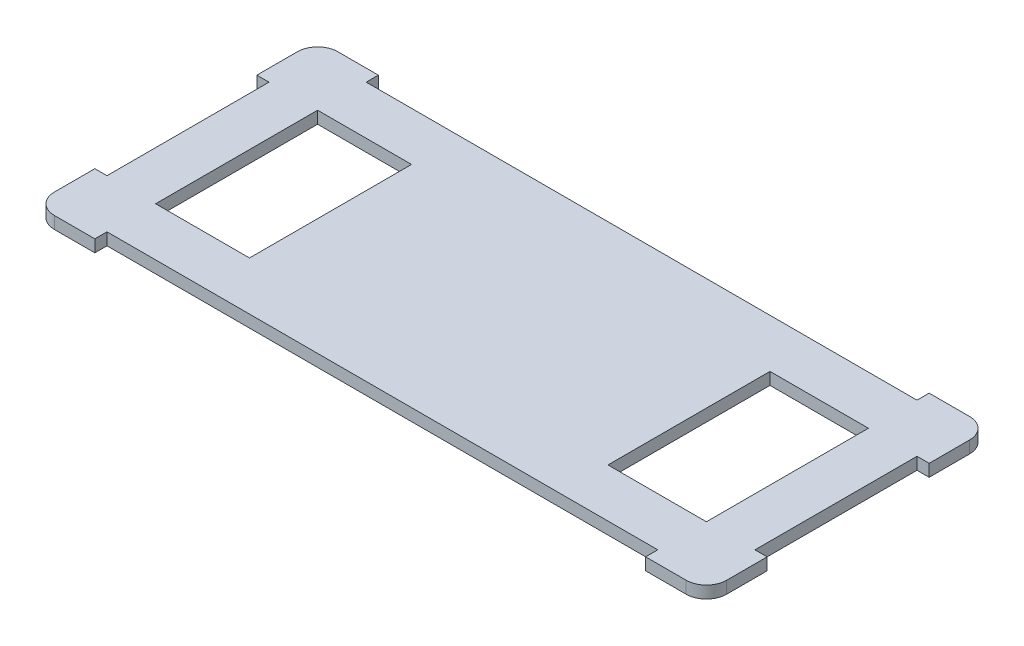
ISO-10303-21;
HEADER;
FILE_DESCRIPTION(('STEP AP214'),'2;1');
FILE_NAME('part.step','',(''),(''),'','','');
FILE_SCHEMA(('AUTOMOTIVE_DESIGN { 1 0 10303 214 1 1 1 1 }'));
ENDSEC;
DATA;
#1=APPLICATION_CONTEXT('core data for automotive mechanical design processes');
#2=APPLICATION_PROTOCOL_DEFINITION('international standard','automotive_design',2000,#1);
#3=PRODUCT_CONTEXT('',#1,'mechanical');
#4=PRODUCT('Part','Part','',(#3));
#5=PRODUCT_RELATED_PRODUCT_CATEGORY('part','',(#4));
#6=PRODUCT_DEFINITION_FORMATION('','',#4);
#7=PRODUCT_DEFINITION_CONTEXT('part definition',#1,'design');
#8=PRODUCT_DEFINITION('design','',#6,#7);
#9=PRODUCT_DEFINITION_SHAPE('','',#8);
#10=(LENGTH_UNIT() NAMED_UNIT(*) SI_UNIT(.MILLI.,.METRE.));
#11=(NAMED_UNIT(*) PLANE_ANGLE_UNIT() SI_UNIT($,.RADIAN.));
#12=(NAMED_UNIT(*) SI_UNIT($,.STERADIAN.) SOLID_ANGLE_UNIT());
#13=UNCERTAINTY_MEASURE_WITH_UNIT(LENGTH_MEASURE(1.E-05),#10,'distance_accuracy_value','');
#14=(GEOMETRIC_REPRESENTATION_CONTEXT(3) GLOBAL_UNCERTAINTY_ASSIGNED_CONTEXT((#13)) GLOBAL_UNIT_ASSIGNED_CONTEXT((#10,
#11,#12)) REPRESENTATION_CONTEXT('',''));
#15=CARTESIAN_POINT('',(0.,0.,0.));
#16=DIRECTION('',(0.,0.,1.));
#17=DIRECTION('',(1.,0.,0.));
#18=AXIS2_PLACEMENT_3D('',#15,#16,#17);
#19=CARTESIAN_POINT('',(-98.3544303797468,-0.0100000000000031,-32.8481012658228));
#20=DIRECTION('',(0.,0.,-1.));
#21=DIRECTION('',(-1.,0.,0.));
#22=AXIS2_PLACEMENT_3D('',#19,#20,#21);
#23=PLANE('',#22);
#24=DIRECTION('',(0.,1.,0.));
#25=VECTOR('',#24,1.);
#26=CARTESIAN_POINT('',(-95.3544303797468,-0.0100000000000031,-32.8481012658228));
#27=LINE('',#26,#25);
#28=CARTESIAN_POINT('',(-95.3544303797468,0.,-32.8481012658228));
#29=VERTEX_POINT('',#28);
#30=CARTESIAN_POINT('',(-95.3544303797468,3.,-32.8481012658228));
#31=VERTEX_POINT('',#30);
#32=EDGE_CURVE('E36',#29,#31,#27,.T.);
#33=ORIENTED_EDGE('',*,*,#32,.T.);
#34=DIRECTION('',(-1.,0.,0.));
#35=VECTOR('',#34,1.);
#36=CARTESIAN_POINT('',(0.,3.,-32.8481012658228));
#37=LINE('',#36,#35);
#38=CARTESIAN_POINT('',(-98.3544303797468,3.,-32.8481012658228));
#39=VERTEX_POINT('',#38);
#40=EDGE_CURVE('E395',#31,#39,#37,.T.);
#41=ORIENTED_EDGE('',*,*,#40,.T.);
#42=DIRECTION('',(0.,1.,0.));
#43=VECTOR('',#42,1.);
#44=CARTESIAN_POINT('',(-98.3544303797468,50.,-32.8481012658228));
#45=LINE('',#44,#43);
#46=CARTESIAN_POINT('',(-98.3544303797468,0.,-32.8481012658228));
#47=VERTEX_POINT('',#46);
#48=EDGE_CURVE('E325',#47,#39,#45,.T.);
#49=ORIENTED_EDGE('',*,*,#48,.F.);
#50=DIRECTION('',(-1.,0.,0.));
#51=VECTOR('',#50,1.);
#52=CARTESIAN_POINT('',(0.,0.,-32.8481012658228));
#53=LINE('',#52,#51);
#54=EDGE_CURVE('E319',#29,#47,#53,.T.);
#55=ORIENTED_EDGE('',*,*,#54,.F.);
#56=EDGE_LOOP('',(#33,#41,#49,#55));
#57=FACE_BOUND('',#56,.T.);
#58=ADVANCED_FACE('F32',(#57),#23,.F.);
#59=CARTESIAN_POINT('',(-95.3544303797468,-0.0100000000000031,-32.8481012658228));
#60=DIRECTION('',(1.,0.,0.));
#61=DIRECTION('',(0.,0.,-1.));
#62=AXIS2_PLACEMENT_3D('',#59,#60,#61);
#63=PLANE('',#62);
#64=DIRECTION('',(0.,1.,0.));
#65=VECTOR('',#64,1.);
#66=CARTESIAN_POINT('',(-95.3544303797468,-0.0100000000000031,7.15189873417722));
#67=LINE('',#66,#65);
#68=CARTESIAN_POINT('',(-95.3544303797468,0.,7.15189873417722));
#69=VERTEX_POINT('',#68);
#70=CARTESIAN_POINT('',(-95.3544303797468,3.,7.15189873417722));
#71=VERTEX_POINT('',#70);
#72=EDGE_CURVE('E463',#69,#71,#67,.T.);
#73=ORIENTED_EDGE('',*,*,#72,.T.);
#74=DIRECTION('',(0.,0.,-1.));
#75=VECTOR('',#74,1.);
#76=CARTESIAN_POINT('',(-95.3544303797468,3.,0.));
#77=LINE('',#76,#75);
#78=EDGE_CURVE('E480',#71,#31,#77,.T.);
#79=ORIENTED_EDGE('',*,*,#78,.T.);
#80=ORIENTED_EDGE('',*,*,#32,.F.);
#81=DIRECTION('',(0.,0.,-1.));
#82=VECTOR('',#81,1.);
#83=CARTESIAN_POINT('',(-95.3544303797468,0.,0.));
#84=LINE('',#83,#82);
#85=EDGE_CURVE('E315',#69,#29,#84,.T.);
#86=ORIENTED_EDGE('',*,*,#85,.F.);
#87=EDGE_LOOP('',(#73,#79,#80,#86));
#88=FACE_BOUND('',#87,.T.);
#89=ADVANCED_FACE('F492',(#88),#63,.F.);
#90=CARTESIAN_POINT('',(-98.3544303797468,-0.0100000000000031,7.15189873417722));
#91=DIRECTION('',(0.,0.,1.));
#92=DIRECTION('',(1.,0.,0.));
#93=AXIS2_PLACEMENT_3D('',#90,#91,#92);
#94=PLANE('',#93);
#95=DIRECTION('',(0.,-1.,0.));
#96=VECTOR('',#95,1.);
#97=CARTESIAN_POINT('',(-98.3544303797468,50.,7.15189873417722));
#98=LINE('',#97,#96);
#99=CARTESIAN_POINT('',(-98.3544303797468,3.,7.15189873417722));
#100=VERTEX_POINT('',#99);
#101=CARTESIAN_POINT('',(-98.3544303797468,0.,7.15189873417722));
#102=VERTEX_POINT('',#101);
#103=EDGE_CURVE('E322',#100,#102,#98,.T.);
#104=ORIENTED_EDGE('',*,*,#103,.F.);
#105=DIRECTION('',(1.,0.,0.));
#106=VECTOR('',#105,1.);
#107=CARTESIAN_POINT('',(0.,3.,7.15189873417733));
#108=LINE('',#107,#106);
#109=EDGE_CURVE('E470',#100,#71,#108,.T.);
#110=ORIENTED_EDGE('',*,*,#109,.T.);
#111=ORIENTED_EDGE('',*,*,#72,.F.);
#112=DIRECTION('',(1.,0.,0.));
#113=VECTOR('',#112,1.);
#114=CARTESIAN_POINT('',(0.,0.,7.15189873417733));
#115=LINE('',#114,#113);
#116=EDGE_CURVE('E312',#102,#69,#115,.T.);
#117=ORIENTED_EDGE('',*,*,#116,.F.);
#118=EDGE_LOOP('',(#104,#110,#111,#117));
#119=FACE_BOUND('',#118,.T.);
#120=ADVANCED_FACE('F508',(#119),#94,.F.);
#121=CARTESIAN_POINT('',(-83.3544303797468,-0.0100000000000031,19.1518987341772));
#122=DIRECTION('',(0.,0.,-1.));
#123=DIRECTION('',(-1.,0.,0.));
#124=AXIS2_PLACEMENT_3D('',#121,#122,#123);
#125=PLANE('',#124);
#126=DIRECTION('',(0.,1.,0.));
#127=VECTOR('',#126,1.);
#128=CARTESIAN_POINT('',(52.6371308016878,-0.0100000000000031,19.1518987341772));
#129=LINE('',#128,#127);
#130=CARTESIAN_POINT('',(52.6371308016878,0.,19.1518987341772));
#131=VERTEX_POINT('',#130);
#132=CARTESIAN_POINT('',(52.6371308016878,3.,19.1518987341772));
#133=VERTEX_POINT('',#132);
#134=EDGE_CURVE('E413',#131,#133,#129,.T.);
#135=ORIENTED_EDGE('',*,*,#134,.T.);
#136=DIRECTION('',(-1.,0.,0.));
#137=VECTOR('',#136,1.);
#138=CARTESIAN_POINT('',(0.,3.,19.1518987341772));
#139=LINE('',#138,#137);
#140=CARTESIAN_POINT('',(-83.3544303797468,3.,19.1518987341772));
#141=VERTEX_POINT('',#140);
#142=EDGE_CURVE('E399',#133,#141,#139,.T.);
#143=ORIENTED_EDGE('',*,*,#142,.T.);
#144=DIRECTION('',(0.,1.,0.));
#145=VECTOR('',#144,1.);
#146=CARTESIAN_POINT('',(-83.3544303797468,-0.0100000000000031,19.1518987341772));
#147=LINE('',#146,#145);
#148=CARTESIAN_POINT('',(-83.3544303797468,0.,19.1518987341772));
#149=VERTEX_POINT('',#148);
#150=EDGE_CURVE('E410',#149,#141,#147,.T.);
#151=ORIENTED_EDGE('',*,*,#150,.F.);
#152=DIRECTION('',(-1.,0.,0.));
#153=VECTOR('',#152,1.);
#154=CARTESIAN_POINT('',(0.,0.,19.1518987341772));
#155=LINE('',#154,#153);
#156=EDGE_CURVE('E380',#131,#149,#155,.T.);
#157=ORIENTED_EDGE('',*,*,#156,.F.);
#158=EDGE_LOOP('',(#135,#143,#151,#157));
#159=FACE_BOUND('',#158,.T.);
#160=ADVANCED_FACE('F530',(#159),#125,.F.);
#161=CARTESIAN_POINT('',(52.6371308016878,-0.0100000000000031,22.1518987341772));
#162=DIRECTION('',(1.,0.,0.));
#163=DIRECTION('',(0.,0.,-1.));
#164=AXIS2_PLACEMENT_3D('',#161,#162,#163);
#165=PLANE('',#164);
#166=DIRECTION('',(0.,-1.,0.));
#167=VECTOR('',#166,1.);
#168=CARTESIAN_POINT('',(52.6371308016877,50.,22.1518987341772));
#169=LINE('',#168,#167);
#170=CARTESIAN_POINT('',(52.6371308016878,3.,22.1518987341772));
#171=VERTEX_POINT('',#170);
#172=CARTESIAN_POINT('',(52.6371308016878,0.,22.1518987341772));
#173=VERTEX_POINT('',#172);
#174=EDGE_CURVE('E316',#171,#173,#169,.T.);
#175=ORIENTED_EDGE('',*,*,#174,.F.);
#176=DIRECTION('',(0.,0.,-1.));
#177=VECTOR('',#176,1.);
#178=CARTESIAN_POINT('',(52.6371308016879,3.,2.43495644026E-13));
#179=LINE('',#178,#177);
#180=EDGE_CURVE('E396',#171,#133,#179,.T.);
#181=ORIENTED_EDGE('',*,*,#180,.T.);
#182=ORIENTED_EDGE('',*,*,#134,.F.);
#183=DIRECTION('',(0.,0.,-1.));
#184=VECTOR('',#183,1.);
#185=CARTESIAN_POINT('',(52.6371308016879,0.,2.43495644026E-13));
#186=LINE('',#185,#184);
#187=EDGE_CURVE('E383',#173,#131,#186,.T.);
#188=ORIENTED_EDGE('',*,*,#187,.F.);
#189=EDGE_LOOP('',(#175,#181,#182,#188));
#190=FACE_BOUND('',#189,.T.);
#191=ADVANCED_FACE('F532',(#190),#165,.F.);
#192=CARTESIAN_POINT('',(-83.3544303797468,-0.0100000000000031,22.1518987341772));
#193=DIRECTION('',(-1.,0.,0.));
#194=DIRECTION('',(0.,0.,1.));
#195=AXIS2_PLACEMENT_3D('',#192,#193,#194);
#196=PLANE('',#195);
#197=ORIENTED_EDGE('',*,*,#150,.T.);
#198=DIRECTION('',(0.,0.,1.));
#199=VECTOR('',#198,1.);
#200=CARTESIAN_POINT('',(-83.3544303797468,3.,0.));
#201=LINE('',#200,#199);
#202=CARTESIAN_POINT('',(-83.3544303797468,3.,22.1518987341772));
#203=VERTEX_POINT('',#202);
#204=EDGE_CURVE('E392',#141,#203,#201,.T.);
#205=ORIENTED_EDGE('',*,*,#204,.T.);
#206=DIRECTION('',(0.,1.,0.));
#207=VECTOR('',#206,1.);
#208=CARTESIAN_POINT('',(-83.3544303797468,-0.0100000000000031,22.1518987341772));
#209=LINE('',#208,#207);
#210=CARTESIAN_POINT('',(-83.3544303797468,0.,22.1518987341772));
#211=VERTEX_POINT('',#210);
#212=EDGE_CURVE('E389',#211,#203,#209,.T.);
#213=ORIENTED_EDGE('',*,*,#212,.F.);
#214=DIRECTION('',(0.,0.,1.));
#215=VECTOR('',#214,1.);
#216=CARTESIAN_POINT('',(-83.3544303797468,0.,0.));
#217=LINE('',#216,#215);
#218=EDGE_CURVE('E321',#149,#211,#217,.T.);
#219=ORIENTED_EDGE('',*,*,#218,.F.);
#220=EDGE_LOOP('',(#197,#205,#213,#219));
#221=FACE_BOUND('',#220,.T.);
#222=ADVANCED_FACE('F524',(#221),#196,.F.);
#223=CARTESIAN_POINT('',(64.6371308016878,-0.0100000000000031,7.15189873417722));
#224=DIRECTION('',(0.,0.,1.));
#225=DIRECTION('',(1.,0.,0.));
#226=AXIS2_PLACEMENT_3D('',#223,#224,#225);
#227=PLANE('',#226);
#228=DIRECTION('',(0.,1.,0.));
#229=VECTOR('',#228,1.);
#230=CARTESIAN_POINT('',(64.6371308016878,-0.0100000000000031,7.15189873417722));
#231=LINE('',#230,#229);
#232=CARTESIAN_POINT('',(64.6371308016878,0.,7.15189873417722));
#233=VERTEX_POINT('',#232);
#234=CARTESIAN_POINT('',(64.6371308016878,3.,7.15189873417722));
#235=VERTEX_POINT('',#234);
#236=EDGE_CURVE('E416',#233,#235,#231,.T.);
#237=ORIENTED_EDGE('',*,*,#236,.T.);
#238=DIRECTION('',(1.,0.,0.));
#239=VECTOR('',#238,1.);
#240=CARTESIAN_POINT('',(0.,3.,7.15189873417722));
#241=LINE('',#240,#239);
#242=CARTESIAN_POINT('',(67.6371308016878,3.,7.15189873417722));
#243=VERTEX_POINT('',#242);
#244=EDGE_CURVE('E401',#235,#243,#241,.T.);
#245=ORIENTED_EDGE('',*,*,#244,.T.);
#246=DIRECTION('',(0.,1.,0.));
#247=VECTOR('',#246,1.);
#248=CARTESIAN_POINT('',(67.6371308016878,-0.0100000000000031,7.15189873417722));
#249=LINE('',#248,#247);
#250=CARTESIAN_POINT('',(67.6371308016878,0.,7.15189873417722));
#251=VERTEX_POINT('',#250);
#252=EDGE_CURVE('E439',#251,#243,#249,.T.);
#253=ORIENTED_EDGE('',*,*,#252,.F.);
#254=DIRECTION('',(1.,0.,0.));
#255=VECTOR('',#254,1.);
#256=CARTESIAN_POINT('',(0.,0.,7.15189873417722));
#257=LINE('',#256,#255);
#258=EDGE_CURVE('E382',#233,#251,#257,.T.);
#259=ORIENTED_EDGE('',*,*,#258,.F.);
#260=EDGE_LOOP('',(#237,#245,#253,#259));
#261=FACE_BOUND('',#260,.T.);
#262=ADVANCED_FACE('F547',(#261),#227,.F.);
#263=CARTESIAN_POINT('',(64.6371308016878,-0.0100000000000031,-32.8481012658228));
#264=DIRECTION('',(0.,0.,-1.));
#265=DIRECTION('',(-1.,0.,0.));
#266=AXIS2_PLACEMENT_3D('',#263,#264,#265);
#267=PLANE('',#266);
#268=DIRECTION('',(0.,-1.,0.));
#269=VECTOR('',#268,1.);
#270=CARTESIAN_POINT('',(67.6371308016878,50.,-32.8481012658228));
#271=LINE('',#270,#269);
#272=CARTESIAN_POINT('',(67.6371308016878,3.,-32.8481012658228));
#273=VERTEX_POINT('',#272);
#274=CARTESIAN_POINT('',(67.6371308016878,0.,-32.8481012658228));
#275=VERTEX_POINT('',#274);
#276=EDGE_CURVE('E391',#273,#275,#271,.T.);
#277=ORIENTED_EDGE('',*,*,#276,.F.);
#278=DIRECTION('',(-1.,0.,0.));
#279=VECTOR('',#278,1.);
#280=CARTESIAN_POINT('',(0.,3.,-32.8481012658228));
#281=LINE('',#280,#279);
#282=CARTESIAN_POINT('',(64.6371308016878,3.,-32.8481012658228));
#283=VERTEX_POINT('',#282);
#284=EDGE_CURVE('E431',#273,#283,#281,.T.);
#285=ORIENTED_EDGE('',*,*,#284,.T.);
#286=DIRECTION('',(0.,1.,0.));
#287=VECTOR('',#286,1.);
#288=CARTESIAN_POINT('',(64.6371308016878,-0.0100000000000031,-32.8481012658228));
#289=LINE('',#288,#287);
#290=CARTESIAN_POINT('',(64.6371308016878,0.,-32.8481012658228));
#291=VERTEX_POINT('',#290);
#292=EDGE_CURVE('E417',#291,#283,#289,.T.);
#293=ORIENTED_EDGE('',*,*,#292,.F.);
#294=DIRECTION('',(-1.,0.,0.));
#295=VECTOR('',#294,1.);
#296=CARTESIAN_POINT('',(0.,0.,-32.8481012658228));
#297=LINE('',#296,#295);
#298=EDGE_CURVE('E448',#275,#291,#297,.T.);
#299=ORIENTED_EDGE('',*,*,#298,.F.);
#300=EDGE_LOOP('',(#277,#285,#293,#299));
#301=FACE_BOUND('',#300,.T.);
#302=ADVANCED_FACE('F556',(#301),#267,.F.);
#303=CARTESIAN_POINT('',(64.6371308016878,-0.0100000000000031,7.15189873417722));
#304=DIRECTION('',(-1.,0.,0.));
#305=DIRECTION('',(0.,0.,1.));
#306=AXIS2_PLACEMENT_3D('',#303,#304,#305);
#307=PLANE('',#306);
#308=ORIENTED_EDGE('',*,*,#292,.T.);
#309=DIRECTION('',(0.,0.,1.));
#310=VECTOR('',#309,1.);
#311=CARTESIAN_POINT('',(64.6371308016878,3.,0.));
#312=LINE('',#311,#310);
#313=EDGE_CURVE('E433',#283,#235,#312,.T.);
#314=ORIENTED_EDGE('',*,*,#313,.T.);
#315=ORIENTED_EDGE('',*,*,#236,.F.);
#316=DIRECTION('',(0.,0.,1.));
#317=VECTOR('',#316,1.);
#318=CARTESIAN_POINT('',(64.6371308016878,0.,0.));
#319=LINE('',#318,#317);
#320=EDGE_CURVE('E445',#291,#233,#319,.T.);
#321=ORIENTED_EDGE('',*,*,#320,.F.);
#322=EDGE_LOOP('',(#308,#314,#315,#321));
#323=FACE_BOUND('',#322,.T.);
#324=ADVANCED_FACE('F554',(#323),#307,.F.);
#325=CARTESIAN_POINT('',(52.6371308016878,-0.0100000000000031,-44.8481012658228));
#326=DIRECTION('',(0.,0.,1.));
#327=DIRECTION('',(1.,0.,0.));
#328=AXIS2_PLACEMENT_3D('',#325,#326,#327);
#329=PLANE('',#328);
#330=DIRECTION('',(0.,1.,0.));
#331=VECTOR('',#330,1.);
#332=CARTESIAN_POINT('',(-83.3544303797469,-0.0100000000000031,-44.8481012658228));
#333=LINE('',#332,#331);
#334=CARTESIAN_POINT('',(-83.3544303797469,0.,-44.8481012658228));
#335=VERTEX_POINT('',#334);
#336=CARTESIAN_POINT('',(-83.3544303797469,3.,-44.8481012658228));
#337=VERTEX_POINT('',#336);
#338=EDGE_CURVE('E279',#335,#337,#333,.T.);
#339=ORIENTED_EDGE('',*,*,#338,.T.);
#340=DIRECTION('',(1.,0.,0.));
#341=VECTOR('',#340,1.);
#342=CARTESIAN_POINT('',(0.,3.,-44.8481012658228));
#343=LINE('',#342,#341);
#344=CARTESIAN_POINT('',(52.6371308016878,3.,-44.8481012658228));
#345=VERTEX_POINT('',#344);
#346=EDGE_CURVE('E460',#337,#345,#343,.T.);
#347=ORIENTED_EDGE('',*,*,#346,.T.);
#348=DIRECTION('',(0.,1.,0.));
#349=VECTOR('',#348,1.);
#350=CARTESIAN_POINT('',(52.6371308016878,-0.0100000000000031,-44.8481012658228));
#351=LINE('',#350,#349);
#352=CARTESIAN_POINT('',(52.6371308016878,0.,-44.8481012658228));
#353=VERTEX_POINT('',#352);
#354=EDGE_CURVE('E420',#353,#345,#351,.T.);
#355=ORIENTED_EDGE('',*,*,#354,.F.);
#356=DIRECTION('',(1.,0.,0.));
#357=VECTOR('',#356,1.);
#358=CARTESIAN_POINT('',(0.,0.,-44.8481012658228));
#359=LINE('',#358,#357);
#360=EDGE_CURVE('E326',#335,#353,#359,.T.);
#361=ORIENTED_EDGE('',*,*,#360,.F.);
#362=EDGE_LOOP('',(#339,#347,#355,#361));
#363=FACE_BOUND('',#362,.T.);
#364=ADVANCED_FACE('F577',(#363),#329,.F.);
#365=CARTESIAN_POINT('',(-83.3544303797469,-0.0100000000000031,-44.8481012658228));
#366=DIRECTION('',(-1.,0.,0.));
#367=DIRECTION('',(0.,0.,1.));
#368=AXIS2_PLACEMENT_3D('',#365,#366,#367);
#369=PLANE('',#368);
#370=DIRECTION('',(0.,-1.,0.));
#371=VECTOR('',#370,1.);
#372=CARTESIAN_POINT('',(-83.3544303797469,50.,-47.8481012658228));
#373=LINE('',#372,#371);
#374=CARTESIAN_POINT('',(-83.3544303797469,3.,-47.8481012658228));
#375=VERTEX_POINT('',#374);
#376=CARTESIAN_POINT('',(-83.3544303797469,0.,-47.8481012658228));
#377=VERTEX_POINT('',#376);
#378=EDGE_CURVE('E441',#375,#377,#373,.T.);
#379=ORIENTED_EDGE('',*,*,#378,.F.);
#380=DIRECTION('',(0.,0.,1.));
#381=VECTOR('',#380,1.);
#382=CARTESIAN_POINT('',(-83.3544303797469,3.,0.));
#383=LINE('',#382,#381);
#384=EDGE_CURVE('E462',#375,#337,#383,.T.);
#385=ORIENTED_EDGE('',*,*,#384,.T.);
#386=ORIENTED_EDGE('',*,*,#338,.F.);
#387=DIRECTION('',(0.,0.,1.));
#388=VECTOR('',#387,1.);
#389=CARTESIAN_POINT('',(-83.3544303797469,0.,0.));
#390=LINE('',#389,#388);
#391=EDGE_CURVE('E474',#377,#335,#390,.T.);
#392=ORIENTED_EDGE('',*,*,#391,.F.);
#393=EDGE_LOOP('',(#379,#385,#386,#392));
#394=FACE_BOUND('',#393,.T.);
#395=ADVANCED_FACE('F581',(#394),#369,.F.);
#396=CARTESIAN_POINT('',(52.6371308016878,-0.0100000000000031,-44.8481012658228));
#397=DIRECTION('',(1.,0.,0.));
#398=DIRECTION('',(0.,0.,-1.));
#399=AXIS2_PLACEMENT_3D('',#396,#397,#398);
#400=PLANE('',#399);
#401=ORIENTED_EDGE('',*,*,#354,.T.);
#402=DIRECTION('',(0.,0.,-1.));
#403=VECTOR('',#402,1.);
#404=CARTESIAN_POINT('',(52.6371308016878,3.,0.));
#405=LINE('',#404,#403);
#406=CARTESIAN_POINT('',(52.6371308016878,3.,-47.8481012658228));
#407=VERTEX_POINT('',#406);
#408=EDGE_CURVE('E434',#345,#407,#405,.T.);
#409=ORIENTED_EDGE('',*,*,#408,.T.);
#410=DIRECTION('',(0.,1.,0.));
#411=VECTOR('',#410,1.);
#412=CARTESIAN_POINT('',(52.6371308016878,-0.0100000000000031,-47.8481012658228));
#413=LINE('',#412,#411);
#414=CARTESIAN_POINT('',(52.6371308016878,0.,-47.8481012658228));
#415=VERTEX_POINT('',#414);
#416=EDGE_CURVE('E468',#415,#407,#413,.T.);
#417=ORIENTED_EDGE('',*,*,#416,.F.);
#418=DIRECTION('',(0.,0.,-1.));
#419=VECTOR('',#418,1.);
#420=CARTESIAN_POINT('',(52.6371308016878,0.,0.));
#421=LINE('',#420,#419);
#422=EDGE_CURVE('E450',#353,#415,#421,.T.);
#423=ORIENTED_EDGE('',*,*,#422,.F.);
#424=EDGE_LOOP('',(#401,#409,#417,#423));
#425=FACE_BOUND('',#424,.T.);
#426=ADVANCED_FACE('F575',(#425),#400,.F.);
#427=CARTESIAN_POINT('',(0.,0.,0.));
#428=DIRECTION('',(0.,1.,0.));
#429=DIRECTION('',(0.,0.,1.));
#430=AXIS2_PLACEMENT_3D('',#427,#428,#429);
#431=PLANE('',#430);
#432=DIRECTION('',(-1.,0.,0.));
#433=VECTOR('',#432,1.);
#434=CARTESIAN_POINT('',(-83.3544303797469,0.,-32.8481012658228));
#435=LINE('',#434,#433);
#436=CARTESIAN_POINT('',(-60.1690754929075,0.,-32.8481012658228));
#437=VERTEX_POINT('',#436);
#438=CARTESIAN_POINT('',(-83.3544303797469,0.,-32.8481012658228));
#439=VERTEX_POINT('',#438);
#440=EDGE_CURVE('E254',#437,#439,#435,.T.);
#441=ORIENTED_EDGE('',*,*,#440,.T.);
#442=DIRECTION('',(0.,0.,1.));
#443=VECTOR('',#442,1.);
#444=CARTESIAN_POINT('',(-83.3544303797469,0.,-32.8481012658228));
#445=LINE('',#444,#443);
#446=CARTESIAN_POINT('',(-83.3544303797469,0.,7.15189873417722));
#447=VERTEX_POINT('',#446);
#448=EDGE_CURVE('E246',#439,#447,#445,.T.);
#449=ORIENTED_EDGE('',*,*,#448,.T.);
#450=DIRECTION('',(1.,0.,0.));
#451=VECTOR('',#450,1.);
#452=CARTESIAN_POINT('',(-83.3544303797469,0.,7.15189873417722));
#453=LINE('',#452,#451);
#454=CARTESIAN_POINT('',(-60.1690754929075,0.,7.15189873417722));
#455=VERTEX_POINT('',#454);
#456=EDGE_CURVE('E257',#447,#455,#453,.T.);
#457=ORIENTED_EDGE('',*,*,#456,.T.);
#458=DIRECTION('',(0.,0.,-1.));
#459=VECTOR('',#458,1.);
#460=CARTESIAN_POINT('',(-60.1690754929075,0.,-32.8481012658228));
#461=LINE('',#460,#459);
#462=EDGE_CURVE('E49',#455,#437,#461,.T.);
#463=ORIENTED_EDGE('',*,*,#462,.T.);
#464=EDGE_LOOP('',(#441,#449,#457,#463));
#465=FACE_BOUND('',#464,.T.);
#466=DIRECTION('',(-1.,0.,0.));
#467=VECTOR('',#466,1.);
#468=CARTESIAN_POINT('',(28.3369496985897,0.,-32.8481012658228));
#469=LINE('',#468,#467);
#470=CARTESIAN_POINT('',(52.6371308016878,0.,-32.8481012658228));
#471=VERTEX_POINT('',#470);
#472=CARTESIAN_POINT('',(28.3369496985897,0.,-32.8481012658228));
#473=VERTEX_POINT('',#472);
#474=EDGE_CURVE('E291',#471,#473,#469,.T.);
#475=ORIENTED_EDGE('',*,*,#474,.T.);
#476=DIRECTION('',(0.,0.,1.));
#477=VECTOR('',#476,1.);
#478=CARTESIAN_POINT('',(28.3369496985897,0.,7.15189873417722));
#479=LINE('',#478,#477);
#480=CARTESIAN_POINT('',(28.3369496985897,0.,7.15189873417722));
#481=VERTEX_POINT('',#480);
#482=EDGE_CURVE('E283',#473,#481,#479,.T.);
#483=ORIENTED_EDGE('',*,*,#482,.T.);
#484=DIRECTION('',(1.,0.,0.));
#485=VECTOR('',#484,1.);
#486=CARTESIAN_POINT('',(28.3369496985897,0.,7.15189873417722));
#487=LINE('',#486,#485);
#488=CARTESIAN_POINT('',(52.6371308016878,0.,7.15189873417722));
#489=VERTEX_POINT('',#488);
#490=EDGE_CURVE('E286',#481,#489,#487,.T.);
#491=ORIENTED_EDGE('',*,*,#490,.T.);
#492=DIRECTION('',(0.,0.,-1.));
#493=VECTOR('',#492,1.);
#494=CARTESIAN_POINT('',(52.6371308016878,0.,7.15189873417722));
#495=LINE('',#494,#493);
#496=EDGE_CURVE('E57',#489,#471,#495,.T.);
#497=ORIENTED_EDGE('',*,*,#496,.T.);
#498=EDGE_LOOP('',(#475,#483,#491,#497));
#499=FACE_BOUND('',#498,.T.);
#500=DIRECTION('',(0.,0.,1.));
#501=VECTOR('',#500,1.);
#502=CARTESIAN_POINT('',(-98.3544303797468,0.,-47.8481012658228));
#503=LINE('',#502,#501);
#504=CARTESIAN_POINT('',(-98.3544303797468,0.,17.1518987341772));
#505=VERTEX_POINT('',#504);
#506=EDGE_CURVE('E11',#102,#505,#503,.T.);
#507=ORIENTED_EDGE('',*,*,#506,.F.);
#508=ORIENTED_EDGE('',*,*,#116,.T.);
#509=ORIENTED_EDGE('',*,*,#85,.T.);
#510=ORIENTED_EDGE('',*,*,#54,.T.);
#511=CARTESIAN_POINT('',(-98.3544303797468,0.,-42.8481012658228));
#512=VERTEX_POINT('',#511);
#513=EDGE_CURVE('E41',#512,#47,#503,.T.);
#514=ORIENTED_EDGE('',*,*,#513,.F.);
#515=CARTESIAN_POINT('',(-93.3544303797468,0.,-42.8481012658228));
#516=DIRECTION('',(0.,1.,0.));
#517=DIRECTION('',(0.,0.,1.));
#518=AXIS2_PLACEMENT_3D('',#515,#516,#517);
#519=CIRCLE('',#518,5.);
#520=CARTESIAN_POINT('',(-93.3544303797468,0.,-47.8481012658228));
#521=VERTEX_POINT('',#520);
#522=EDGE_CURVE('E360',#512,#521,#519,.F.);
#523=ORIENTED_EDGE('',*,*,#522,.T.);
#524=DIRECTION('',(-1.,0.,0.));
#525=VECTOR('',#524,1.);
#526=CARTESIAN_POINT('',(-98.3544303797468,0.,-47.8481012658228));
#527=LINE('',#526,#525);
#528=EDGE_CURVE('E426',#377,#521,#527,.T.);
#529=ORIENTED_EDGE('',*,*,#528,.F.);
#530=ORIENTED_EDGE('',*,*,#391,.T.);
#531=ORIENTED_EDGE('',*,*,#360,.T.);
#532=ORIENTED_EDGE('',*,*,#422,.T.);
#533=CARTESIAN_POINT('',(62.6371308016877,0.,-47.8481012658228));
#534=VERTEX_POINT('',#533);
#535=EDGE_CURVE('E376',#534,#415,#527,.T.);
#536=ORIENTED_EDGE('',*,*,#535,.F.);
#537=CARTESIAN_POINT('',(62.6371308016877,0.,-42.8481012658228));
#538=DIRECTION('',(0.,1.,0.));
#539=DIRECTION('',(0.,0.,1.));
#540=AXIS2_PLACEMENT_3D('',#537,#538,#539);
#541=CIRCLE('',#540,5.);
#542=CARTESIAN_POINT('',(67.6371308016878,0.,-42.8481012658228));
#543=VERTEX_POINT('',#542);
#544=EDGE_CURVE('E363',#534,#543,#541,.F.);
#545=ORIENTED_EDGE('',*,*,#544,.T.);
#546=DIRECTION('',(0.,0.,-1.));
#547=VECTOR('',#546,1.);
#548=CARTESIAN_POINT('',(67.6371308016878,0.,-47.8481012658228));
#549=LINE('',#548,#547);
#550=EDGE_CURVE('E409',#275,#543,#549,.T.);
#551=ORIENTED_EDGE('',*,*,#550,.F.);
#552=ORIENTED_EDGE('',*,*,#298,.T.);
#553=ORIENTED_EDGE('',*,*,#320,.T.);
#554=ORIENTED_EDGE('',*,*,#258,.T.);
#555=CARTESIAN_POINT('',(67.6371308016878,0.,17.1518987341772));
#556=VERTEX_POINT('',#555);
#557=EDGE_CURVE('E423',#556,#251,#549,.T.);
#558=ORIENTED_EDGE('',*,*,#557,.F.);
#559=CARTESIAN_POINT('',(62.6371308016878,0.,17.1518987341772));
#560=DIRECTION('',(0.,1.,0.));
#561=DIRECTION('',(0.,0.,1.));
#562=AXIS2_PLACEMENT_3D('',#559,#560,#561);
#563=CIRCLE('',#562,5.);
#564=CARTESIAN_POINT('',(62.6371308016878,0.,22.1518987341772));
#565=VERTEX_POINT('',#564);
#566=EDGE_CURVE('E366',#556,#565,#563,.F.);
#567=ORIENTED_EDGE('',*,*,#566,.T.);
#568=DIRECTION('',(1.,0.,0.));
#569=VECTOR('',#568,1.);
#570=CARTESIAN_POINT('',(-98.3544303797468,0.,22.1518987341772));
#571=LINE('',#570,#569);
#572=EDGE_CURVE('E379',#173,#565,#571,.T.);
#573=ORIENTED_EDGE('',*,*,#572,.F.);
#574=ORIENTED_EDGE('',*,*,#187,.T.);
#575=ORIENTED_EDGE('',*,*,#156,.T.);
#576=ORIENTED_EDGE('',*,*,#218,.T.);
#577=CARTESIAN_POINT('',(-93.3544303797468,0.,22.1518987341772));
#578=VERTEX_POINT('',#577);
#579=EDGE_CURVE('E406',#578,#211,#571,.T.);
#580=ORIENTED_EDGE('',*,*,#579,.F.);
#581=CARTESIAN_POINT('',(-93.3544303797468,0.,17.1518987341772));
#582=DIRECTION('',(0.,1.,0.));
#583=DIRECTION('',(0.,0.,1.));
#584=AXIS2_PLACEMENT_3D('',#581,#582,#583);
#585=CIRCLE('',#584,5.);
#586=EDGE_CURVE('E369',#578,#505,#585,.F.);
#587=ORIENTED_EDGE('',*,*,#586,.T.);
#588=EDGE_LOOP('',(#507,#508,#509,#510,#514,#523,#529,#530,#531,#532,#536,#545,#551,#552,#553,
#554,#558,#567,#573,#574,#575,#576,#580,#587));
#589=FACE_BOUND('',#588,.T.);
#590=ADVANCED_FACE('F34',(#465,#499,#589),#431,.F.);
#591=CARTESIAN_POINT('',(-98.3544303797468,50.,-47.8481012658228));
#592=DIRECTION('',(1.,0.,0.));
#593=DIRECTION('',(0.,0.,-1.));
#594=AXIS2_PLACEMENT_3D('',#591,#592,#593);
#595=PLANE('',#594);
#596=ORIENTED_EDGE('',*,*,#513,.T.);
#597=ORIENTED_EDGE('',*,*,#48,.T.);
#598=DIRECTION('',(0.,0.,-1.));
#599=VECTOR('',#598,1.);
#600=CARTESIAN_POINT('',(-98.3544303797468,3.,-47.8481012658228));
#601=LINE('',#600,#599);
#602=CARTESIAN_POINT('',(-98.3544303797468,3.,-42.8481012658228));
#603=VERTEX_POINT('',#602);
#604=EDGE_CURVE('E341',#39,#603,#601,.T.);
#605=ORIENTED_EDGE('',*,*,#604,.T.);
#606=DIRECTION('',(0.,-1.,0.));
#607=VECTOR('',#606,1.);
#608=CARTESIAN_POINT('',(-98.3544303797468,50.,-42.8481012658228));
#609=LINE('',#608,#607);
#610=EDGE_CURVE('E372',#603,#512,#609,.T.);
#611=ORIENTED_EDGE('',*,*,#610,.T.);
#612=EDGE_LOOP('',(#596,#597,#605,#611));
#613=FACE_BOUND('',#612,.T.);
#614=ADVANCED_FACE('F500',(#613),#595,.F.);
#615=CARTESIAN_POINT('',(-93.3544303797468,50.,-42.8481012658228));
#616=DIRECTION('',(0.,-1.,0.));
#617=DIRECTION('',(0.,0.,-1.));
#618=AXIS2_PLACEMENT_3D('',#615,#616,#617);
#619=CYLINDRICAL_SURFACE('',#618,5.);
#620=CARTESIAN_POINT('',(-93.3544303797468,3.,-42.8481012658228));
#621=DIRECTION('',(0.,-1.,0.));
#622=DIRECTION('',(0.,0.,-1.));
#623=AXIS2_PLACEMENT_3D('',#620,#621,#622);
#624=CIRCLE('',#623,5.);
#625=CARTESIAN_POINT('',(-93.3544303797468,3.,-47.8481012658228));
#626=VERTEX_POINT('',#625);
#627=EDGE_CURVE('E332',#626,#603,#624,.F.);
#628=ORIENTED_EDGE('',*,*,#627,.F.);
#629=DIRECTION('',(0.,-1.,0.));
#630=VECTOR('',#629,1.);
#631=CARTESIAN_POINT('',(-93.3544303797468,50.,-47.8481012658228));
#632=LINE('',#631,#630);
#633=EDGE_CURVE('E355',#521,#626,#632,.F.);
#634=ORIENTED_EDGE('',*,*,#633,.F.);
#635=ORIENTED_EDGE('',*,*,#522,.F.);
#636=ORIENTED_EDGE('',*,*,#610,.F.);
#637=EDGE_LOOP('',(#628,#634,#635,#636));
#638=FACE_BOUND('',#637,.T.);
#639=ADVANCED_FACE('F585',(#638),#619,.T.);
#640=CARTESIAN_POINT('',(-98.3544303797468,50.,-47.8481012658228));
#641=DIRECTION('',(0.,0.,1.));
#642=DIRECTION('',(1.,0.,0.));
#643=AXIS2_PLACEMENT_3D('',#640,#641,#642);
#644=PLANE('',#643);
#645=DIRECTION('',(1.,0.,0.));
#646=VECTOR('',#645,1.);
#647=CARTESIAN_POINT('',(-98.3544303797468,3.,-47.8481012658228));
#648=LINE('',#647,#646);
#649=EDGE_CURVE('E457',#626,#375,#648,.T.);
#650=ORIENTED_EDGE('',*,*,#649,.T.);
#651=ORIENTED_EDGE('',*,*,#378,.T.);
#652=ORIENTED_EDGE('',*,*,#528,.T.);
#653=ORIENTED_EDGE('',*,*,#633,.T.);
#654=EDGE_LOOP('',(#650,#651,#652,#653));
#655=FACE_BOUND('',#654,.T.);
#656=ADVANCED_FACE('F583',(#655),#644,.F.);
#657=ORIENTED_EDGE('',*,*,#535,.T.);
#658=ORIENTED_EDGE('',*,*,#416,.T.);
#659=CARTESIAN_POINT('',(62.6371308016877,3.,-47.8481012658228));
#660=VERTEX_POINT('',#659);
#661=EDGE_CURVE('E348',#407,#660,#648,.T.);
#662=ORIENTED_EDGE('',*,*,#661,.T.);
#663=DIRECTION('',(0.,-1.,0.));
#664=VECTOR('',#663,1.);
#665=CARTESIAN_POINT('',(62.6371308016877,50.,-47.8481012658228));
#666=LINE('',#665,#664);
#667=EDGE_CURVE('E358',#660,#534,#666,.T.);
#668=ORIENTED_EDGE('',*,*,#667,.T.);
#669=EDGE_LOOP('',(#657,#658,#662,#668));
#670=FACE_BOUND('',#669,.T.);
#671=ADVANCED_FACE('F569',(#670),#644,.F.);
#672=CARTESIAN_POINT('',(62.6371308016877,50.,-42.8481012658228));
#673=DIRECTION('',(0.,-1.,0.));
#674=DIRECTION('',(0.,0.,-1.));
#675=AXIS2_PLACEMENT_3D('',#672,#673,#674);
#676=CYLINDRICAL_SURFACE('',#675,5.);
#677=CARTESIAN_POINT('',(62.6371308016877,3.,-42.8481012658228));
#678=DIRECTION('',(0.,-1.,0.));
#679=DIRECTION('',(0.,0.,-1.));
#680=AXIS2_PLACEMENT_3D('',#677,#678,#679);
#681=CIRCLE('',#680,5.);
#682=CARTESIAN_POINT('',(67.6371308016878,3.,-42.8481012658228));
#683=VERTEX_POINT('',#682);
#684=EDGE_CURVE('E329',#683,#660,#681,.F.);
#685=ORIENTED_EDGE('',*,*,#684,.F.);
#686=DIRECTION('',(0.,-1.,0.));
#687=VECTOR('',#686,1.);
#688=CARTESIAN_POINT('',(67.6371308016878,50.,-42.8481012658228));
#689=LINE('',#688,#687);
#690=EDGE_CURVE('E350',#543,#683,#689,.F.);
#691=ORIENTED_EDGE('',*,*,#690,.F.);
#692=ORIENTED_EDGE('',*,*,#544,.F.);
#693=ORIENTED_EDGE('',*,*,#667,.F.);
#694=EDGE_LOOP('',(#685,#691,#692,#693));
#695=FACE_BOUND('',#694,.T.);
#696=ADVANCED_FACE('F565',(#695),#676,.T.);
#697=CARTESIAN_POINT('',(67.6371308016878,50.,-47.8481012658228));
#698=DIRECTION('',(-1.,0.,0.));
#699=DIRECTION('',(0.,0.,1.));
#700=AXIS2_PLACEMENT_3D('',#697,#698,#699);
#701=PLANE('',#700);
#702=DIRECTION('',(0.,0.,1.));
#703=VECTOR('',#702,1.);
#704=CARTESIAN_POINT('',(67.6371308016878,3.,-47.8481012658228));
#705=LINE('',#704,#703);
#706=EDGE_CURVE('E427',#683,#273,#705,.T.);
#707=ORIENTED_EDGE('',*,*,#706,.T.);
#708=ORIENTED_EDGE('',*,*,#276,.T.);
#709=ORIENTED_EDGE('',*,*,#550,.T.);
#710=ORIENTED_EDGE('',*,*,#690,.T.);
#711=EDGE_LOOP('',(#707,#708,#709,#710));
#712=FACE_BOUND('',#711,.T.);
#713=ADVANCED_FACE('F559',(#712),#701,.F.);
#714=ORIENTED_EDGE('',*,*,#557,.T.);
#715=ORIENTED_EDGE('',*,*,#252,.T.);
#716=CARTESIAN_POINT('',(67.6371308016878,3.,17.1518987341772));
#717=VERTEX_POINT('',#716);
#718=EDGE_CURVE('E430',#243,#717,#705,.T.);
#719=ORIENTED_EDGE('',*,*,#718,.T.);
#720=DIRECTION('',(0.,-1.,0.));
#721=VECTOR('',#720,1.);
#722=CARTESIAN_POINT('',(67.6371308016878,50.,17.1518987341772));
#723=LINE('',#722,#721);
#724=EDGE_CURVE('E353',#717,#556,#723,.T.);
#725=ORIENTED_EDGE('',*,*,#724,.T.);
#726=EDGE_LOOP('',(#714,#715,#719,#725));
#727=FACE_BOUND('',#726,.T.);
#728=ADVANCED_FACE('F544',(#727),#701,.F.);
#729=CARTESIAN_POINT('',(62.6371308016878,50.,17.1518987341772));
#730=DIRECTION('',(0.,-1.,0.));
#731=DIRECTION('',(0.,0.,-1.));
#732=AXIS2_PLACEMENT_3D('',#729,#730,#731);
#733=CYLINDRICAL_SURFACE('',#732,5.);
#734=CARTESIAN_POINT('',(62.6371308016878,3.,17.1518987341772));
#735=DIRECTION('',(0.,-1.,0.));
#736=DIRECTION('',(0.,0.,-1.));
#737=AXIS2_PLACEMENT_3D('',#734,#735,#736);
#738=CIRCLE('',#737,5.);
#739=CARTESIAN_POINT('',(62.6371308016878,3.,22.1518987341772));
#740=VERTEX_POINT('',#739);
#741=EDGE_CURVE('E333',#740,#717,#738,.F.);
#742=ORIENTED_EDGE('',*,*,#741,.F.);
#743=DIRECTION('',(0.,-1.,0.));
#744=VECTOR('',#743,1.);
#745=CARTESIAN_POINT('',(62.6371308016878,50.,22.1518987341772));
#746=LINE('',#745,#744);
#747=EDGE_CURVE('E344',#565,#740,#746,.F.);
#748=ORIENTED_EDGE('',*,*,#747,.F.);
#749=ORIENTED_EDGE('',*,*,#566,.F.);
#750=ORIENTED_EDGE('',*,*,#724,.F.);
#751=EDGE_LOOP('',(#742,#748,#749,#750));
#752=FACE_BOUND('',#751,.T.);
#753=ADVANCED_FACE('F541',(#752),#733,.T.);
#754=CARTESIAN_POINT('',(-98.3544303797468,50.,22.1518987341772));
#755=DIRECTION('',(0.,0.,-1.));
#756=DIRECTION('',(-1.,0.,0.));
#757=AXIS2_PLACEMENT_3D('',#754,#755,#756);
#758=PLANE('',#757);
#759=DIRECTION('',(-1.,0.,0.));
#760=VECTOR('',#759,1.);
#761=CARTESIAN_POINT('',(-98.3544303797468,3.,22.1518987341772));
#762=LINE('',#761,#760);
#763=EDGE_CURVE('E402',#740,#171,#762,.T.);
#764=ORIENTED_EDGE('',*,*,#763,.T.);
#765=ORIENTED_EDGE('',*,*,#174,.T.);
#766=ORIENTED_EDGE('',*,*,#572,.T.);
#767=ORIENTED_EDGE('',*,*,#747,.T.);
#768=EDGE_LOOP('',(#764,#765,#766,#767));
#769=FACE_BOUND('',#768,.T.);
#770=ADVANCED_FACE('F535',(#769),#758,.F.);
#771=ORIENTED_EDGE('',*,*,#579,.T.);
#772=ORIENTED_EDGE('',*,*,#212,.T.);
#773=CARTESIAN_POINT('',(-93.3544303797468,3.,22.1518987341772));
#774=VERTEX_POINT('',#773);
#775=EDGE_CURVE('E405',#203,#774,#762,.T.);
#776=ORIENTED_EDGE('',*,*,#775,.T.);
#777=DIRECTION('',(0.,-1.,0.));
#778=VECTOR('',#777,1.);
#779=CARTESIAN_POINT('',(-93.3544303797468,50.,22.1518987341772));
#780=LINE('',#779,#778);
#781=EDGE_CURVE('E347',#774,#578,#780,.T.);
#782=ORIENTED_EDGE('',*,*,#781,.T.);
#783=EDGE_LOOP('',(#771,#772,#776,#782));
#784=FACE_BOUND('',#783,.T.);
#785=ADVANCED_FACE('F520',(#784),#758,.F.);
#786=CARTESIAN_POINT('',(-93.3544303797468,50.,17.1518987341772));
#787=DIRECTION('',(0.,-1.,0.));
#788=DIRECTION('',(0.,0.,-1.));
#789=AXIS2_PLACEMENT_3D('',#786,#787,#788);
#790=CYLINDRICAL_SURFACE('',#789,5.);
#791=CARTESIAN_POINT('',(-93.3544303797468,3.,17.1518987341772));
#792=DIRECTION('',(0.,-1.,0.));
#793=DIRECTION('',(0.,0.,-1.));
#794=AXIS2_PLACEMENT_3D('',#791,#792,#793);
#795=CIRCLE('',#794,5.);
#796=CARTESIAN_POINT('',(-98.3544303797468,3.,17.1518987341772));
#797=VERTEX_POINT('',#796);
#798=EDGE_CURVE('E328',#797,#774,#795,.F.);
#799=ORIENTED_EDGE('',*,*,#798,.F.);
#800=DIRECTION('',(0.,-1.,0.));
#801=VECTOR('',#800,1.);
#802=CARTESIAN_POINT('',(-98.3544303797468,50.,17.1518987341772));
#803=LINE('',#802,#801);
#804=EDGE_CURVE('E374',#505,#797,#803,.F.);
#805=ORIENTED_EDGE('',*,*,#804,.F.);
#806=ORIENTED_EDGE('',*,*,#586,.F.);
#807=ORIENTED_EDGE('',*,*,#781,.F.);
#808=EDGE_LOOP('',(#799,#805,#806,#807));
#809=FACE_BOUND('',#808,.T.);
#810=ADVANCED_FACE('F517',(#809),#790,.T.);
#811=EDGE_CURVE('E336',#797,#100,#601,.T.);
#812=ORIENTED_EDGE('',*,*,#811,.T.);
#813=ORIENTED_EDGE('',*,*,#103,.T.);
#814=ORIENTED_EDGE('',*,*,#506,.T.);
#815=ORIENTED_EDGE('',*,*,#804,.T.);
#816=EDGE_LOOP('',(#812,#813,#814,#815));
#817=FACE_BOUND('',#816,.T.);
#818=ADVANCED_FACE('F510',(#817),#595,.F.);
#819=CARTESIAN_POINT('',(0.,3.,0.));
#820=DIRECTION('',(0.,1.,0.));
#821=DIRECTION('',(0.,0.,1.));
#822=AXIS2_PLACEMENT_3D('',#819,#820,#821);
#823=PLANE('',#822);
#824=DIRECTION('',(0.,0.,1.));
#825=VECTOR('',#824,1.);
#826=CARTESIAN_POINT('',(-83.3544303797469,3.,-32.8481012658228));
#827=LINE('',#826,#825);
#828=CARTESIAN_POINT('',(-83.3544303797469,3.,-32.8481012658228));
#829=VERTEX_POINT('',#828);
#830=CARTESIAN_POINT('',(-83.3544303797469,3.,7.15189873417722));
#831=VERTEX_POINT('',#830);
#832=EDGE_CURVE('E249',#829,#831,#827,.T.);
#833=ORIENTED_EDGE('',*,*,#832,.F.);
#834=DIRECTION('',(-1.,0.,0.));
#835=VECTOR('',#834,1.);
#836=CARTESIAN_POINT('',(-83.3544303797469,3.,-32.8481012658228));
#837=LINE('',#836,#835);
#838=CARTESIAN_POINT('',(-60.1690754929075,3.,-32.8481012658228));
#839=VERTEX_POINT('',#838);
#840=EDGE_CURVE('E263',#839,#829,#837,.T.);
#841=ORIENTED_EDGE('',*,*,#840,.F.);
#842=DIRECTION('',(0.,0.,-1.));
#843=VECTOR('',#842,1.);
#844=CARTESIAN_POINT('',(-60.1690754929075,3.,-32.8481012658228));
#845=LINE('',#844,#843);
#846=CARTESIAN_POINT('',(-60.1690754929075,3.,7.15189873417722));
#847=VERTEX_POINT('',#846);
#848=EDGE_CURVE('E266',#847,#839,#845,.T.);
#849=ORIENTED_EDGE('',*,*,#848,.F.);
#850=DIRECTION('',(1.,0.,0.));
#851=VECTOR('',#850,1.);
#852=CARTESIAN_POINT('',(-83.3544303797469,3.,7.15189873417722));
#853=LINE('',#852,#851);
#854=EDGE_CURVE('E272',#831,#847,#853,.T.);
#855=ORIENTED_EDGE('',*,*,#854,.F.);
#856=EDGE_LOOP('',(#833,#841,#849,#855));
#857=FACE_BOUND('',#856,.T.);
#858=DIRECTION('',(0.,0.,1.));
#859=VECTOR('',#858,1.);
#860=CARTESIAN_POINT('',(28.3369496985897,3.,7.15189873417722));
#861=LINE('',#860,#859);
#862=CARTESIAN_POINT('',(28.3369496985897,3.,-32.8481012658228));
#863=VERTEX_POINT('',#862);
#864=CARTESIAN_POINT('',(28.3369496985897,3.,7.15189873417722));
#865=VERTEX_POINT('',#864);
#866=EDGE_CURVE('E295',#863,#865,#861,.T.);
#867=ORIENTED_EDGE('',*,*,#866,.F.);
#868=DIRECTION('',(-1.,0.,0.));
#869=VECTOR('',#868,1.);
#870=CARTESIAN_POINT('',(28.3369496985897,3.,-32.8481012658228));
#871=LINE('',#870,#869);
#872=CARTESIAN_POINT('',(52.6371308016878,3.,-32.8481012658228));
#873=VERTEX_POINT('',#872);
#874=EDGE_CURVE('E287',#873,#863,#871,.T.);
#875=ORIENTED_EDGE('',*,*,#874,.F.);
#876=DIRECTION('',(0.,0.,-1.));
#877=VECTOR('',#876,1.);
#878=CARTESIAN_POINT('',(52.6371308016878,3.,7.15189873417722));
#879=LINE('',#878,#877);
#880=CARTESIAN_POINT('',(52.6371308016878,3.,7.15189873417722));
#881=VERTEX_POINT('',#880);
#882=EDGE_CURVE('E300',#881,#873,#879,.T.);
#883=ORIENTED_EDGE('',*,*,#882,.F.);
#884=DIRECTION('',(1.,0.,0.));
#885=VECTOR('',#884,1.);
#886=CARTESIAN_POINT('',(28.3369496985897,3.,7.15189873417722));
#887=LINE('',#886,#885);
#888=EDGE_CURVE('E297',#865,#881,#887,.T.);
#889=ORIENTED_EDGE('',*,*,#888,.F.);
#890=EDGE_LOOP('',(#867,#875,#883,#889));
#891=FACE_BOUND('',#890,.T.);
#892=ORIENTED_EDGE('',*,*,#109,.F.);
#893=ORIENTED_EDGE('',*,*,#811,.F.);
#894=ORIENTED_EDGE('',*,*,#798,.T.);
#895=ORIENTED_EDGE('',*,*,#775,.F.);
#896=ORIENTED_EDGE('',*,*,#204,.F.);
#897=ORIENTED_EDGE('',*,*,#142,.F.);
#898=ORIENTED_EDGE('',*,*,#180,.F.);
#899=ORIENTED_EDGE('',*,*,#763,.F.);
#900=ORIENTED_EDGE('',*,*,#741,.T.);
#901=ORIENTED_EDGE('',*,*,#718,.F.);
#902=ORIENTED_EDGE('',*,*,#244,.F.);
#903=ORIENTED_EDGE('',*,*,#313,.F.);
#904=ORIENTED_EDGE('',*,*,#284,.F.);
#905=ORIENTED_EDGE('',*,*,#706,.F.);
#906=ORIENTED_EDGE('',*,*,#684,.T.);
#907=ORIENTED_EDGE('',*,*,#661,.F.);
#908=ORIENTED_EDGE('',*,*,#408,.F.);
#909=ORIENTED_EDGE('',*,*,#346,.F.);
#910=ORIENTED_EDGE('',*,*,#384,.F.);
#911=ORIENTED_EDGE('',*,*,#649,.F.);
#912=ORIENTED_EDGE('',*,*,#627,.T.);
#913=ORIENTED_EDGE('',*,*,#604,.F.);
#914=ORIENTED_EDGE('',*,*,#40,.F.);
#915=ORIENTED_EDGE('',*,*,#78,.F.);
#916=EDGE_LOOP('',(#892,#893,#894,#895,#896,#897,#898,#899,#900,#901,#902,#903,#904,#905,#906,
#907,#908,#909,#910,#911,#912,#913,#914,#915));
#917=FACE_BOUND('',#916,.T.);
#918=ADVANCED_FACE('F494',(#857,#891,#917),#823,.T.);
#919=CARTESIAN_POINT('',(28.3369496985897,0.,7.15189873417722));
#920=DIRECTION('',(-1.,0.,0.));
#921=DIRECTION('',(0.,0.,1.));
#922=AXIS2_PLACEMENT_3D('',#919,#920,#921);
#923=PLANE('',#922);
#924=ORIENTED_EDGE('',*,*,#866,.T.);
#925=DIRECTION('',(0.,1.,0.));
#926=VECTOR('',#925,1.);
#927=CARTESIAN_POINT('',(28.3369496985897,0.,7.15189873417722));
#928=LINE('',#927,#926);
#929=EDGE_CURVE('E294',#481,#865,#928,.T.);
#930=ORIENTED_EDGE('',*,*,#929,.F.);
#931=ORIENTED_EDGE('',*,*,#482,.F.);
#932=DIRECTION('',(0.,1.,0.));
#933=VECTOR('',#932,1.);
#934=CARTESIAN_POINT('',(28.3369496985897,0.,-32.8481012658228));
#935=LINE('',#934,#933);
#936=EDGE_CURVE('E273',#473,#863,#935,.T.);
#937=ORIENTED_EDGE('',*,*,#936,.T.);
#938=EDGE_LOOP('',(#924,#930,#931,#937));
#939=FACE_BOUND('',#938,.T.);
#940=ADVANCED_FACE('F616',(#939),#923,.F.);
#941=CARTESIAN_POINT('',(28.3369496985897,0.,-32.8481012658228));
#942=DIRECTION('',(0.,0.,-1.));
#943=DIRECTION('',(-1.,0.,0.));
#944=AXIS2_PLACEMENT_3D('',#941,#942,#943);
#945=PLANE('',#944);
#946=ORIENTED_EDGE('',*,*,#874,.T.);
#947=ORIENTED_EDGE('',*,*,#936,.F.);
#948=ORIENTED_EDGE('',*,*,#474,.F.);
#949=DIRECTION('',(0.,1.,0.));
#950=VECTOR('',#949,1.);
#951=CARTESIAN_POINT('',(52.6371308016878,0.,-32.8481012658228));
#952=LINE('',#951,#950);
#953=EDGE_CURVE('E306',#471,#873,#952,.T.);
#954=ORIENTED_EDGE('',*,*,#953,.T.);
#955=EDGE_LOOP('',(#946,#947,#948,#954));
#956=FACE_BOUND('',#955,.T.);
#957=ADVANCED_FACE('F645',(#956),#945,.F.);
#958=CARTESIAN_POINT('',(52.6371308016878,0.,7.15189873417722));
#959=DIRECTION('',(1.,0.,0.));
#960=DIRECTION('',(0.,0.,-1.));
#961=AXIS2_PLACEMENT_3D('',#958,#959,#960);
#962=PLANE('',#961);
#963=ORIENTED_EDGE('',*,*,#882,.T.);
#964=ORIENTED_EDGE('',*,*,#953,.F.);
#965=ORIENTED_EDGE('',*,*,#496,.F.);
#966=DIRECTION('',(0.,1.,0.));
#967=VECTOR('',#966,1.);
#968=CARTESIAN_POINT('',(52.6371308016878,0.,7.15189873417722));
#969=LINE('',#968,#967);
#970=EDGE_CURVE('E308',#489,#881,#969,.T.);
#971=ORIENTED_EDGE('',*,*,#970,.T.);
#972=EDGE_LOOP('',(#963,#964,#965,#971));
#973=FACE_BOUND('',#972,.T.);
#974=ADVANCED_FACE('F650',(#973),#962,.F.);
#975=CARTESIAN_POINT('',(28.3369496985897,0.,7.15189873417722));
#976=DIRECTION('',(0.,0.,1.));
#977=DIRECTION('',(1.,0.,0.));
#978=AXIS2_PLACEMENT_3D('',#975,#976,#977);
#979=PLANE('',#978);
#980=ORIENTED_EDGE('',*,*,#888,.T.);
#981=ORIENTED_EDGE('',*,*,#970,.F.);
#982=ORIENTED_EDGE('',*,*,#490,.F.);
#983=ORIENTED_EDGE('',*,*,#929,.T.);
#984=EDGE_LOOP('',(#980,#981,#982,#983));
#985=FACE_BOUND('',#984,.T.);
#986=ADVANCED_FACE('F647',(#985),#979,.F.);
#987=CARTESIAN_POINT('',(-83.3544303797469,0.,-32.8481012658228));
#988=DIRECTION('',(-1.,0.,0.));
#989=DIRECTION('',(0.,0.,1.));
#990=AXIS2_PLACEMENT_3D('',#987,#988,#989);
#991=PLANE('',#990);
#992=ORIENTED_EDGE('',*,*,#832,.T.);
#993=DIRECTION('',(0.,1.,0.));
#994=VECTOR('',#993,1.);
#995=CARTESIAN_POINT('',(-83.3544303797469,0.,7.15189873417722));
#996=LINE('',#995,#994);
#997=EDGE_CURVE('E242',#447,#831,#996,.T.);
#998=ORIENTED_EDGE('',*,*,#997,.F.);
#999=ORIENTED_EDGE('',*,*,#448,.F.);
#1000=DIRECTION('',(0.,1.,0.));
#1001=VECTOR('',#1000,1.);
#1002=CARTESIAN_POINT('',(-83.3544303797469,0.,-32.8481012658228));
#1003=LINE('',#1002,#1001);
#1004=EDGE_CURVE('E277',#439,#829,#1003,.T.);
#1005=ORIENTED_EDGE('',*,*,#1004,.T.);
#1006=EDGE_LOOP('',(#992,#998,#999,#1005));
#1007=FACE_BOUND('',#1006,.T.);
#1008=ADVANCED_FACE('F244',(#1007),#991,.F.);
#1009=CARTESIAN_POINT('',(-83.3544303797469,0.,-32.8481012658228));
#1010=DIRECTION('',(0.,0.,-1.));
#1011=DIRECTION('',(-1.,0.,0.));
#1012=AXIS2_PLACEMENT_3D('',#1009,#1010,#1011);
#1013=PLANE('',#1012);
#1014=ORIENTED_EDGE('',*,*,#840,.T.);
#1015=ORIENTED_EDGE('',*,*,#1004,.F.);
#1016=ORIENTED_EDGE('',*,*,#440,.F.);
#1017=DIRECTION('',(0.,1.,0.));
#1018=VECTOR('',#1017,1.);
#1019=CARTESIAN_POINT('',(-60.1690754929075,0.,-32.8481012658228));
#1020=LINE('',#1019,#1018);
#1021=EDGE_CURVE('E280',#437,#839,#1020,.T.);
#1022=ORIENTED_EDGE('',*,*,#1021,.T.);
#1023=EDGE_LOOP('',(#1014,#1015,#1016,#1022));
#1024=FACE_BOUND('',#1023,.T.);
#1025=ADVANCED_FACE('F659',(#1024),#1013,.F.);
#1026=CARTESIAN_POINT('',(-60.1690754929075,0.,-32.8481012658228));
#1027=DIRECTION('',(1.,0.,0.));
#1028=DIRECTION('',(0.,0.,-1.));
#1029=AXIS2_PLACEMENT_3D('',#1026,#1027,#1028);
#1030=PLANE('',#1029);
#1031=ORIENTED_EDGE('',*,*,#848,.T.);
#1032=ORIENTED_EDGE('',*,*,#1021,.F.);
#1033=ORIENTED_EDGE('',*,*,#462,.F.);
#1034=DIRECTION('',(0.,1.,0.));
#1035=VECTOR('',#1034,1.);
#1036=CARTESIAN_POINT('',(-60.1690754929075,0.,7.15189873417722));
#1037=LINE('',#1036,#1035);
#1038=EDGE_CURVE('E253',#455,#847,#1037,.T.);
#1039=ORIENTED_EDGE('',*,*,#1038,.T.);
#1040=EDGE_LOOP('',(#1031,#1032,#1033,#1039));
#1041=FACE_BOUND('',#1040,.T.);
#1042=ADVANCED_FACE('F662',(#1041),#1030,.F.);
#1043=CARTESIAN_POINT('',(-83.3544303797469,0.,7.15189873417722));
#1044=DIRECTION('',(0.,0.,1.));
#1045=DIRECTION('',(1.,0.,0.));
#1046=AXIS2_PLACEMENT_3D('',#1043,#1044,#1045);
#1047=PLANE('',#1046);
#1048=ORIENTED_EDGE('',*,*,#854,.T.);
#1049=ORIENTED_EDGE('',*,*,#1038,.F.);
#1050=ORIENTED_EDGE('',*,*,#456,.F.);
#1051=ORIENTED_EDGE('',*,*,#997,.T.);
#1052=EDGE_LOOP('',(#1048,#1049,#1050,#1051));
#1053=FACE_BOUND('',#1052,.T.);
#1054=ADVANCED_FACE('F258',(#1053),#1047,.F.);
#1055=CLOSED_SHELL('',(#58,#89,#120,#160,#191,#222,#262,#302,#324,#364,#395,#426,#590,#614,#639,
#656,#671,#696,#713,#728,#753,#770,#785,#810,#818,#918,#940,#957,#974,#986,#1008,#1025,#1042,#1054));
#1056=MANIFOLD_SOLID_BREP('B2',#1055);
#1057=ADVANCED_BREP_SHAPE_REPRESENTATION('',(#18,#1056),#14);
#1058=SHAPE_DEFINITION_REPRESENTATION(#9,#1057);
ENDSEC;
END-ISO-10303-21;
